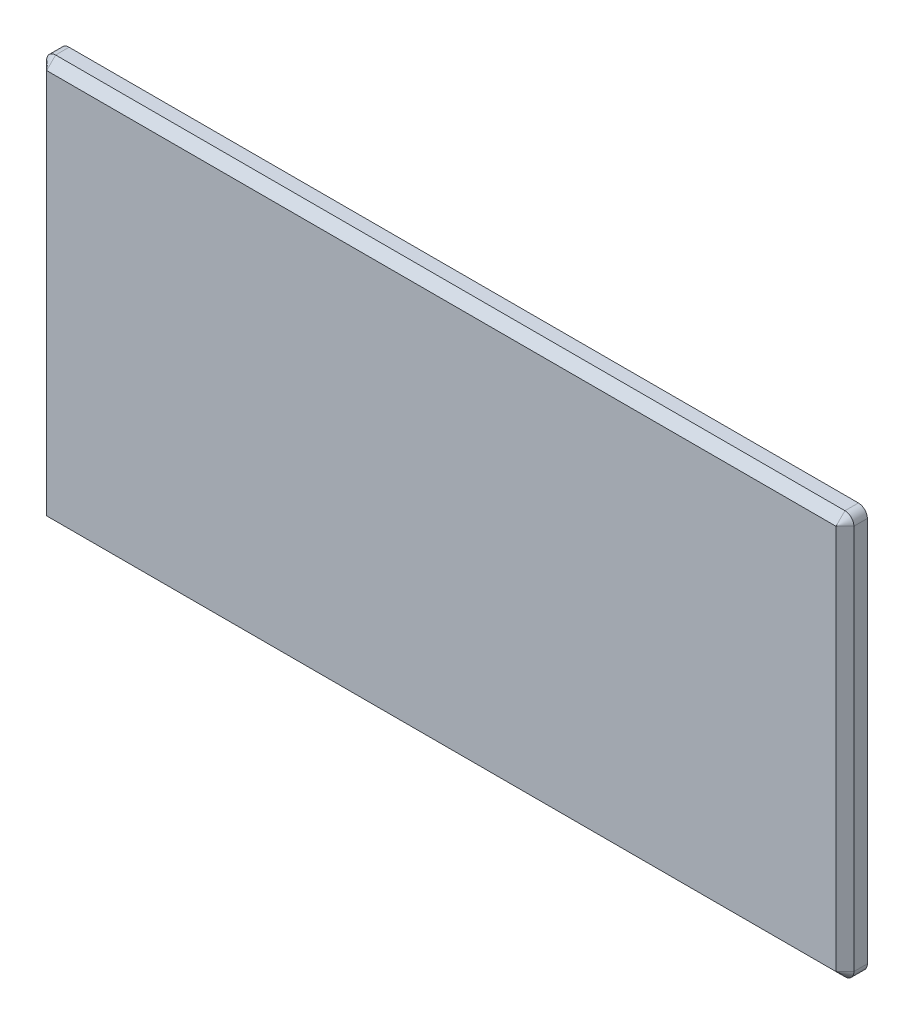
ISO-10303-21;
HEADER;
FILE_DESCRIPTION(('STEP AP214'),'2;1');
FILE_NAME('part.step','',(''),(''),'','','');
FILE_SCHEMA(('AUTOMOTIVE_DESIGN { 1 0 10303 214 1 1 1 1 }'));
ENDSEC;
DATA;
#1=APPLICATION_CONTEXT('core data for automotive mechanical design processes');
#2=APPLICATION_PROTOCOL_DEFINITION('international standard','automotive_design',2000,#1);
#3=PRODUCT_CONTEXT('',#1,'mechanical');
#4=PRODUCT('Part','Part','',(#3));
#5=PRODUCT_RELATED_PRODUCT_CATEGORY('part','',(#4));
#6=PRODUCT_DEFINITION_FORMATION('','',#4);
#7=PRODUCT_DEFINITION_CONTEXT('part definition',#1,'design');
#8=PRODUCT_DEFINITION('design','',#6,#7);
#9=PRODUCT_DEFINITION_SHAPE('','',#8);
#10=(LENGTH_UNIT() NAMED_UNIT(*) SI_UNIT(.MILLI.,.METRE.));
#11=(NAMED_UNIT(*) PLANE_ANGLE_UNIT() SI_UNIT($,.RADIAN.));
#12=(NAMED_UNIT(*) SI_UNIT($,.STERADIAN.) SOLID_ANGLE_UNIT());
#13=UNCERTAINTY_MEASURE_WITH_UNIT(LENGTH_MEASURE(1.E-05),#10,'distance_accuracy_value','');
#14=(GEOMETRIC_REPRESENTATION_CONTEXT(3) GLOBAL_UNCERTAINTY_ASSIGNED_CONTEXT((#13)) GLOBAL_UNIT_ASSIGNED_CONTEXT((#10,
#11,#12)) REPRESENTATION_CONTEXT('',''));
#15=CARTESIAN_POINT('',(0.,0.,0.));
#16=DIRECTION('',(0.,0.,1.));
#17=DIRECTION('',(1.,0.,0.));
#18=AXIS2_PLACEMENT_3D('',#15,#16,#17);
#19=CARTESIAN_POINT('',(45.,-22.5,2.5));
#20=DIRECTION('',(-1.,0.,0.));
#21=DIRECTION('',(0.,0.,1.));
#22=AXIS2_PLACEMENT_3D('',#19,#20,#21);
#23=PLANE('',#22);
#24=DIRECTION('',(0.,0.,-1.));
#25=VECTOR('',#24,1.);
#26=CARTESIAN_POINT('',(45.,21.5,2.5));
#27=LINE('',#26,#25);
#28=CARTESIAN_POINT('',(45.,21.5,0.));
#29=VERTEX_POINT('',#28);
#30=CARTESIAN_POINT('',(45.,21.5,1.5));
#31=VERTEX_POINT('',#30);
#32=EDGE_CURVE('E151',#29,#31,#27,.F.);
#33=ORIENTED_EDGE('',*,*,#32,.T.);
#34=DIRECTION('',(0.,-1.,0.));
#35=VECTOR('',#34,1.);
#36=CARTESIAN_POINT('',(45.,-22.5,1.5));
#37=LINE('',#36,#35);
#38=CARTESIAN_POINT('',(45.,-21.5,1.5));
#39=VERTEX_POINT('',#38);
#40=EDGE_CURVE('E170',#31,#39,#37,.T.);
#41=ORIENTED_EDGE('',*,*,#40,.T.);
#42=DIRECTION('',(0.,0.,-1.));
#43=VECTOR('',#42,1.);
#44=CARTESIAN_POINT('',(45.,-21.5,2.5));
#45=LINE('',#44,#43);
#46=CARTESIAN_POINT('',(45.,-21.5,0.));
#47=VERTEX_POINT('',#46);
#48=EDGE_CURVE('E149',#39,#47,#45,.T.);
#49=ORIENTED_EDGE('',*,*,#48,.T.);
#50=DIRECTION('',(0.,1.,0.));
#51=VECTOR('',#50,1.);
#52=CARTESIAN_POINT('',(45.,-22.5,0.));
#53=LINE('',#52,#51);
#54=EDGE_CURVE('E199',#47,#29,#53,.T.);
#55=ORIENTED_EDGE('',*,*,#54,.T.);
#56=EDGE_LOOP('',(#33,#41,#49,#55));
#57=FACE_BOUND('',#56,.T.);
#58=ADVANCED_FACE('F32',(#57),#23,.F.);
#59=CARTESIAN_POINT('',(-45.,22.5,2.5));
#60=DIRECTION('',(0.,-1.,0.));
#61=DIRECTION('',(0.,0.,-1.));
#62=AXIS2_PLACEMENT_3D('',#59,#60,#61);
#63=PLANE('',#62);
#64=DIRECTION('',(0.,0.,-1.));
#65=VECTOR('',#64,1.);
#66=CARTESIAN_POINT('',(-44.,22.5,2.5));
#67=LINE('',#66,#65);
#68=CARTESIAN_POINT('',(-44.,22.5,0.));
#69=VERTEX_POINT('',#68);
#70=CARTESIAN_POINT('',(-44.,22.5,1.5));
#71=VERTEX_POINT('',#70);
#72=EDGE_CURVE('E146',#69,#71,#67,.F.);
#73=ORIENTED_EDGE('',*,*,#72,.T.);
#74=DIRECTION('',(1.,0.,0.));
#75=VECTOR('',#74,1.);
#76=CARTESIAN_POINT('',(-45.,22.5,1.5));
#77=LINE('',#76,#75);
#78=CARTESIAN_POINT('',(44.,22.5,1.5));
#79=VERTEX_POINT('',#78);
#80=EDGE_CURVE('E166',#71,#79,#77,.T.);
#81=ORIENTED_EDGE('',*,*,#80,.T.);
#82=DIRECTION('',(0.,0.,-1.));
#83=VECTOR('',#82,1.);
#84=CARTESIAN_POINT('',(44.,22.5,2.5));
#85=LINE('',#84,#83);
#86=CARTESIAN_POINT('',(44.,22.5,0.));
#87=VERTEX_POINT('',#86);
#88=EDGE_CURVE('E144',#79,#87,#85,.T.);
#89=ORIENTED_EDGE('',*,*,#88,.T.);
#90=DIRECTION('',(-1.,0.,0.));
#91=VECTOR('',#90,1.);
#92=CARTESIAN_POINT('',(-45.,22.5,0.));
#93=LINE('',#92,#91);
#94=EDGE_CURVE('E134',#87,#69,#93,.T.);
#95=ORIENTED_EDGE('',*,*,#94,.T.);
#96=EDGE_LOOP('',(#73,#81,#89,#95));
#97=FACE_BOUND('',#96,.T.);
#98=ADVANCED_FACE('F253',(#97),#63,.F.);
#99=CARTESIAN_POINT('',(-45.,-22.5,2.5));
#100=DIRECTION('',(1.,0.,0.));
#101=DIRECTION('',(0.,0.,-1.));
#102=AXIS2_PLACEMENT_3D('',#99,#100,#101);
#103=PLANE('',#102);
#104=DIRECTION('',(0.,0.,-1.));
#105=VECTOR('',#104,1.);
#106=CARTESIAN_POINT('',(-45.,-21.5,2.5));
#107=LINE('',#106,#105);
#108=CARTESIAN_POINT('',(-45.,-21.5,0.));
#109=VERTEX_POINT('',#108);
#110=CARTESIAN_POINT('',(-45.,-21.5,1.5));
#111=VERTEX_POINT('',#110);
#112=EDGE_CURVE('E121',#109,#111,#107,.F.);
#113=ORIENTED_EDGE('',*,*,#112,.T.);
#114=DIRECTION('',(0.,1.,0.));
#115=VECTOR('',#114,1.);
#116=CARTESIAN_POINT('',(-45.,-22.5,1.5));
#117=LINE('',#116,#115);
#118=CARTESIAN_POINT('',(-45.,21.5,1.5));
#119=VERTEX_POINT('',#118);
#120=EDGE_CURVE('E11',#111,#119,#117,.T.);
#121=ORIENTED_EDGE('',*,*,#120,.T.);
#122=DIRECTION('',(0.,0.,-1.));
#123=VECTOR('',#122,1.);
#124=CARTESIAN_POINT('',(-45.,21.5,2.5));
#125=LINE('',#124,#123);
#126=CARTESIAN_POINT('',(-45.,21.5,0.));
#127=VERTEX_POINT('',#126);
#128=EDGE_CURVE('E125',#119,#127,#125,.T.);
#129=ORIENTED_EDGE('',*,*,#128,.T.);
#130=DIRECTION('',(0.,-1.,0.));
#131=VECTOR('',#130,1.);
#132=CARTESIAN_POINT('',(-45.,-22.5,0.));
#133=LINE('',#132,#131);
#134=EDGE_CURVE('E131',#127,#109,#133,.T.);
#135=ORIENTED_EDGE('',*,*,#134,.T.);
#136=EDGE_LOOP('',(#113,#121,#129,#135));
#137=FACE_BOUND('',#136,.T.);
#138=ADVANCED_FACE('F258',(#137),#103,.F.);
#139=CARTESIAN_POINT('',(-45.,-22.5,2.5));
#140=DIRECTION('',(0.,1.,0.));
#141=DIRECTION('',(0.,0.,1.));
#142=AXIS2_PLACEMENT_3D('',#139,#140,#141);
#143=PLANE('',#142);
#144=DIRECTION('',(0.,0.,-1.));
#145=VECTOR('',#144,1.);
#146=CARTESIAN_POINT('',(44.,-22.5,2.5));
#147=LINE('',#146,#145);
#148=CARTESIAN_POINT('',(44.,-22.5,0.));
#149=VERTEX_POINT('',#148);
#150=CARTESIAN_POINT('',(44.,-22.5,1.5));
#151=VERTEX_POINT('',#150);
#152=EDGE_CURVE('E117',#149,#151,#147,.F.);
#153=ORIENTED_EDGE('',*,*,#152,.T.);
#154=DIRECTION('',(-1.,0.,0.));
#155=VECTOR('',#154,1.);
#156=CARTESIAN_POINT('',(-45.,-22.5,1.5));
#157=LINE('',#156,#155);
#158=CARTESIAN_POINT('',(-44.,-22.5,1.5));
#159=VERTEX_POINT('',#158);
#160=EDGE_CURVE('E56',#151,#159,#157,.T.);
#161=ORIENTED_EDGE('',*,*,#160,.T.);
#162=DIRECTION('',(0.,0.,-1.));
#163=VECTOR('',#162,1.);
#164=CARTESIAN_POINT('',(-44.,-22.5,2.5));
#165=LINE('',#164,#163);
#166=CARTESIAN_POINT('',(-44.,-22.5,0.));
#167=VERTEX_POINT('',#166);
#168=EDGE_CURVE('E109',#159,#167,#165,.T.);
#169=ORIENTED_EDGE('',*,*,#168,.T.);
#170=DIRECTION('',(1.,0.,0.));
#171=VECTOR('',#170,1.);
#172=CARTESIAN_POINT('',(-45.,-22.5,0.));
#173=LINE('',#172,#171);
#174=EDGE_CURVE('E113',#167,#149,#173,.T.);
#175=ORIENTED_EDGE('',*,*,#174,.T.);
#176=EDGE_LOOP('',(#153,#161,#169,#175));
#177=FACE_BOUND('',#176,.T.);
#178=ADVANCED_FACE('F111',(#177),#143,.F.);
#179=CARTESIAN_POINT('',(0.,0.,2.5));
#180=DIRECTION('',(0.,0.,-1.));
#181=DIRECTION('',(-1.,0.,0.));
#182=AXIS2_PLACEMENT_3D('',#179,#180,#181);
#183=PLANE('',#182);
#184=DIRECTION('',(0.,1.,0.));
#185=VECTOR('',#184,1.);
#186=CARTESIAN_POINT('',(44.,0.,2.5));
#187=LINE('',#186,#185);
#188=CARTESIAN_POINT('',(44.,-21.5,2.5));
#189=VERTEX_POINT('',#188);
#190=CARTESIAN_POINT('',(44.,21.5,2.5));
#191=VERTEX_POINT('',#190);
#192=EDGE_CURVE('E161',#189,#191,#187,.T.);
#193=ORIENTED_EDGE('',*,*,#192,.T.);
#194=DIRECTION('',(-1.,0.,0.));
#195=VECTOR('',#194,1.);
#196=CARTESIAN_POINT('',(0.,21.5,2.5));
#197=LINE('',#196,#195);
#198=CARTESIAN_POINT('',(-44.,21.5,2.5));
#199=VERTEX_POINT('',#198);
#200=EDGE_CURVE('E163',#191,#199,#197,.T.);
#201=ORIENTED_EDGE('',*,*,#200,.T.);
#202=DIRECTION('',(0.,-1.,0.));
#203=VECTOR('',#202,1.);
#204=CARTESIAN_POINT('',(-44.,0.,2.5));
#205=LINE('',#204,#203);
#206=CARTESIAN_POINT('',(-44.,-21.5,2.5));
#207=VERTEX_POINT('',#206);
#208=EDGE_CURVE('E157',#199,#207,#205,.T.);
#209=ORIENTED_EDGE('',*,*,#208,.T.);
#210=DIRECTION('',(1.,0.,0.));
#211=VECTOR('',#210,1.);
#212=CARTESIAN_POINT('',(0.,-21.5,2.5));
#213=LINE('',#212,#211);
#214=EDGE_CURVE('E159',#207,#189,#213,.T.);
#215=ORIENTED_EDGE('',*,*,#214,.T.);
#216=EDGE_LOOP('',(#193,#201,#209,#215));
#217=FACE_BOUND('',#216,.T.);
#218=ADVANCED_FACE('F232',(#217),#183,.F.);
#219=CARTESIAN_POINT('',(0.,0.,0.));
#220=DIRECTION('',(0.,0.,-1.));
#221=DIRECTION('',(-1.,0.,0.));
#222=AXIS2_PLACEMENT_3D('',#219,#220,#221);
#223=PLANE('',#222);
#224=CARTESIAN_POINT('',(-22.5,0.,0.));
#225=DIRECTION('',(0.,0.,-1.));
#226=DIRECTION('',(-1.,0.,0.));
#227=AXIS2_PLACEMENT_3D('',#224,#225,#226);
#228=CIRCLE('',#227,4.);
#229=CARTESIAN_POINT('',(-26.5,0.,0.));
#230=VERTEX_POINT('',#229);
#231=EDGE_CURVE('E215',#230,#230,#228,.T.);
#232=ORIENTED_EDGE('',*,*,#231,.F.);
#233=EDGE_LOOP('',(#232));
#234=FACE_BOUND('',#233,.T.);
#235=CARTESIAN_POINT('',(22.5,0.,0.));
#236=DIRECTION('',(0.,0.,-1.));
#237=DIRECTION('',(-1.,0.,0.));
#238=AXIS2_PLACEMENT_3D('',#235,#236,#237);
#239=CIRCLE('',#238,4.);
#240=CARTESIAN_POINT('',(18.5,0.,0.));
#241=VERTEX_POINT('',#240);
#242=EDGE_CURVE('E209',#241,#241,#239,.T.);
#243=ORIENTED_EDGE('',*,*,#242,.F.);
#244=EDGE_LOOP('',(#243));
#245=FACE_BOUND('',#244,.T.);
#246=ORIENTED_EDGE('',*,*,#174,.F.);
#247=CARTESIAN_POINT('',(-44.,-21.5,0.));
#248=DIRECTION('',(0.,0.,-1.));
#249=DIRECTION('',(-1.,0.,0.));
#250=AXIS2_PLACEMENT_3D('',#247,#248,#249);
#251=CIRCLE('',#250,1.);
#252=EDGE_CURVE('E119',#167,#109,#251,.T.);
#253=ORIENTED_EDGE('',*,*,#252,.T.);
#254=ORIENTED_EDGE('',*,*,#134,.F.);
#255=CARTESIAN_POINT('',(-44.,21.5,0.));
#256=DIRECTION('',(0.,0.,-1.));
#257=DIRECTION('',(-1.,0.,0.));
#258=AXIS2_PLACEMENT_3D('',#255,#256,#257);
#259=CIRCLE('',#258,1.);
#260=EDGE_CURVE('E126',#127,#69,#259,.T.);
#261=ORIENTED_EDGE('',*,*,#260,.T.);
#262=ORIENTED_EDGE('',*,*,#94,.F.);
#263=CARTESIAN_POINT('',(44.,21.5,0.));
#264=DIRECTION('',(0.,0.,-1.));
#265=DIRECTION('',(-1.,0.,0.));
#266=AXIS2_PLACEMENT_3D('',#263,#264,#265);
#267=CIRCLE('',#266,1.);
#268=EDGE_CURVE('E139',#87,#29,#267,.T.);
#269=ORIENTED_EDGE('',*,*,#268,.T.);
#270=ORIENTED_EDGE('',*,*,#54,.F.);
#271=CARTESIAN_POINT('',(44.,-21.5,0.));
#272=DIRECTION('',(0.,0.,-1.));
#273=DIRECTION('',(-1.,0.,0.));
#274=AXIS2_PLACEMENT_3D('',#271,#272,#273);
#275=CIRCLE('',#274,1.);
#276=EDGE_CURVE('E116',#47,#149,#275,.T.);
#277=ORIENTED_EDGE('',*,*,#276,.T.);
#278=EDGE_LOOP('',(#246,#253,#254,#261,#262,#269,#270,#277));
#279=FACE_BOUND('',#278,.T.);
#280=ADVANCED_FACE('F128',(#234,#245,#279),#223,.T.);
#281=CARTESIAN_POINT('',(-44.,-21.5,2.5));
#282=DIRECTION('',(0.,0.,-1.));
#283=DIRECTION('',(-1.,0.,0.));
#284=AXIS2_PLACEMENT_3D('',#281,#282,#283);
#285=CYLINDRICAL_SURFACE('',#284,1.);
#286=ORIENTED_EDGE('',*,*,#168,.F.);
#287=CARTESIAN_POINT('',(-44.,-21.5,1.5));
#288=DIRECTION('',(0.,0.,-1.));
#289=DIRECTION('',(-1.,0.,0.));
#290=AXIS2_PLACEMENT_3D('',#287,#288,#289);
#291=CIRCLE('',#290,1.);
#292=EDGE_CURVE('E41',#159,#111,#291,.T.);
#293=ORIENTED_EDGE('',*,*,#292,.T.);
#294=ORIENTED_EDGE('',*,*,#112,.F.);
#295=ORIENTED_EDGE('',*,*,#252,.F.);
#296=EDGE_LOOP('',(#286,#293,#294,#295));
#297=FACE_BOUND('',#296,.T.);
#298=ADVANCED_FACE('F120',(#297),#285,.T.);
#299=CARTESIAN_POINT('',(-44.,21.5,2.5));
#300=DIRECTION('',(0.,0.,-1.));
#301=DIRECTION('',(-1.,0.,0.));
#302=AXIS2_PLACEMENT_3D('',#299,#300,#301);
#303=CYLINDRICAL_SURFACE('',#302,1.);
#304=ORIENTED_EDGE('',*,*,#128,.F.);
#305=CARTESIAN_POINT('',(-44.,21.5,1.5));
#306=DIRECTION('',(0.,0.,-1.));
#307=DIRECTION('',(-1.,0.,0.));
#308=AXIS2_PLACEMENT_3D('',#305,#306,#307);
#309=CIRCLE('',#308,1.);
#310=EDGE_CURVE('E154',#119,#71,#309,.T.);
#311=ORIENTED_EDGE('',*,*,#310,.T.);
#312=ORIENTED_EDGE('',*,*,#72,.F.);
#313=ORIENTED_EDGE('',*,*,#260,.F.);
#314=EDGE_LOOP('',(#304,#311,#312,#313));
#315=FACE_BOUND('',#314,.T.);
#316=ADVANCED_FACE('F265',(#315),#303,.T.);
#317=CARTESIAN_POINT('',(44.,21.5,2.5));
#318=DIRECTION('',(0.,0.,-1.));
#319=DIRECTION('',(-1.,0.,0.));
#320=AXIS2_PLACEMENT_3D('',#317,#318,#319);
#321=CYLINDRICAL_SURFACE('',#320,1.);
#322=ORIENTED_EDGE('',*,*,#88,.F.);
#323=CARTESIAN_POINT('',(44.,21.5,1.5));
#324=DIRECTION('',(0.,0.,-1.));
#325=DIRECTION('',(-1.,0.,0.));
#326=AXIS2_PLACEMENT_3D('',#323,#324,#325);
#327=CIRCLE('',#326,1.);
#328=EDGE_CURVE('E168',#79,#31,#327,.T.);
#329=ORIENTED_EDGE('',*,*,#328,.T.);
#330=ORIENTED_EDGE('',*,*,#32,.F.);
#331=ORIENTED_EDGE('',*,*,#268,.F.);
#332=EDGE_LOOP('',(#322,#329,#330,#331));
#333=FACE_BOUND('',#332,.T.);
#334=ADVANCED_FACE('F268',(#333),#321,.T.);
#335=CARTESIAN_POINT('',(44.,-21.5,2.5));
#336=DIRECTION('',(0.,0.,-1.));
#337=DIRECTION('',(-1.,0.,0.));
#338=AXIS2_PLACEMENT_3D('',#335,#336,#337);
#339=CYLINDRICAL_SURFACE('',#338,1.);
#340=ORIENTED_EDGE('',*,*,#48,.F.);
#341=CARTESIAN_POINT('',(44.,-21.5,1.5));
#342=DIRECTION('',(0.,0.,-1.));
#343=DIRECTION('',(-1.,0.,0.));
#344=AXIS2_PLACEMENT_3D('',#341,#342,#343);
#345=CIRCLE('',#344,1.);
#346=EDGE_CURVE('E172',#39,#151,#345,.T.);
#347=ORIENTED_EDGE('',*,*,#346,.T.);
#348=ORIENTED_EDGE('',*,*,#152,.F.);
#349=ORIENTED_EDGE('',*,*,#276,.F.);
#350=EDGE_LOOP('',(#340,#347,#348,#349));
#351=FACE_BOUND('',#350,.T.);
#352=ADVANCED_FACE('F272',(#351),#339,.T.);
#353=CARTESIAN_POINT('',(44.,-21.5,1.5));
#354=DIRECTION('',(0.,0.,-1.));
#355=DIRECTION('',(-1.,0.,0.));
#356=AXIS2_PLACEMENT_3D('',#353,#354,#355);
#357=CONICAL_SURFACE('',#356,0.999999999999987,0.785398163397442);
#358=DIRECTION('',(0.,0.707106781186543,0.707106781186552));
#359=VECTOR('',#358,1.);
#360=CARTESIAN_POINT('',(44.,-22.5,1.5));
#361=LINE('',#360,#359);
#362=EDGE_CURVE('E192',#151,#189,#361,.T.);
#363=ORIENTED_EDGE('',*,*,#362,.F.);
#364=ORIENTED_EDGE('',*,*,#346,.F.);
#365=DIRECTION('',(0.707106781186543,0.,-0.707106781186552));
#366=VECTOR('',#365,1.);
#367=CARTESIAN_POINT('',(44.,-21.5,2.5));
#368=LINE('',#367,#366);
#369=EDGE_CURVE('E36',#189,#39,#368,.T.);
#370=ORIENTED_EDGE('',*,*,#369,.F.);
#371=EDGE_LOOP('',(#363,#364,#370));
#372=FACE_BOUND('',#371,.T.);
#373=ADVANCED_FACE('F34',(#372),#357,.T.);
#374=CARTESIAN_POINT('',(44.,0.,2.5));
#375=DIRECTION('',(-0.707106781186552,0.,-0.707106781186543));
#376=DIRECTION('',(0.,1.,0.));
#377=AXIS2_PLACEMENT_3D('',#374,#375,#376);
#378=PLANE('',#377);
#379=ORIENTED_EDGE('',*,*,#369,.T.);
#380=ORIENTED_EDGE('',*,*,#40,.F.);
#381=DIRECTION('',(0.707106781186543,0.,-0.707106781186552));
#382=VECTOR('',#381,1.);
#383=CARTESIAN_POINT('',(44.,21.5,2.5));
#384=LINE('',#383,#382);
#385=EDGE_CURVE('E190',#191,#31,#384,.T.);
#386=ORIENTED_EDGE('',*,*,#385,.F.);
#387=ORIENTED_EDGE('',*,*,#192,.F.);
#388=EDGE_LOOP('',(#379,#380,#386,#387));
#389=FACE_BOUND('',#388,.T.);
#390=ADVANCED_FACE('F294',(#389),#378,.F.);
#391=CARTESIAN_POINT('',(0.,-21.5,2.5));
#392=DIRECTION('',(0.,0.707106781186552,-0.707106781186543));
#393=DIRECTION('',(1.,0.,0.));
#394=AXIS2_PLACEMENT_3D('',#391,#392,#393);
#395=PLANE('',#394);
#396=ORIENTED_EDGE('',*,*,#362,.T.);
#397=ORIENTED_EDGE('',*,*,#214,.F.);
#398=DIRECTION('',(0.,0.707106781186543,0.707106781186552));
#399=VECTOR('',#398,1.);
#400=CARTESIAN_POINT('',(-44.,-22.5,1.5));
#401=LINE('',#400,#399);
#402=EDGE_CURVE('E187',#159,#207,#401,.T.);
#403=ORIENTED_EDGE('',*,*,#402,.F.);
#404=ORIENTED_EDGE('',*,*,#160,.F.);
#405=EDGE_LOOP('',(#396,#397,#403,#404));
#406=FACE_BOUND('',#405,.T.);
#407=ADVANCED_FACE('F291',(#406),#395,.F.);
#408=CARTESIAN_POINT('',(44.,21.5,1.5));
#409=DIRECTION('',(0.,0.,-1.));
#410=DIRECTION('',(-1.,0.,0.));
#411=AXIS2_PLACEMENT_3D('',#408,#409,#410);
#412=CONICAL_SURFACE('',#411,0.999999999999987,0.785398163397442);
#413=ORIENTED_EDGE('',*,*,#385,.T.);
#414=ORIENTED_EDGE('',*,*,#328,.F.);
#415=DIRECTION('',(0.,0.707106781186543,-0.707106781186552));
#416=VECTOR('',#415,1.);
#417=CARTESIAN_POINT('',(44.,21.5,2.5));
#418=LINE('',#417,#416);
#419=EDGE_CURVE('E184',#191,#79,#418,.T.);
#420=ORIENTED_EDGE('',*,*,#419,.F.);
#421=EDGE_LOOP('',(#413,#414,#420));
#422=FACE_BOUND('',#421,.T.);
#423=ADVANCED_FACE('F287',(#422),#412,.T.);
#424=CARTESIAN_POINT('',(-44.,-21.5,1.5));
#425=DIRECTION('',(0.,0.,-1.));
#426=DIRECTION('',(-1.,0.,0.));
#427=AXIS2_PLACEMENT_3D('',#424,#425,#426);
#428=CONICAL_SURFACE('',#427,0.999999999999987,0.785398163397442);
#429=ORIENTED_EDGE('',*,*,#292,.F.);
#430=ORIENTED_EDGE('',*,*,#402,.T.);
#431=DIRECTION('',(0.707106781186543,0.,0.707106781186552));
#432=VECTOR('',#431,1.);
#433=CARTESIAN_POINT('',(-45.,-21.5,1.5));
#434=LINE('',#433,#432);
#435=EDGE_CURVE('E181',#111,#207,#434,.T.);
#436=ORIENTED_EDGE('',*,*,#435,.F.);
#437=EDGE_LOOP('',(#429,#430,#436));
#438=FACE_BOUND('',#437,.T.);
#439=ADVANCED_FACE('F283',(#438),#428,.T.);
#440=CARTESIAN_POINT('',(0.,21.5,2.5));
#441=DIRECTION('',(0.,-0.707106781186552,-0.707106781186543));
#442=DIRECTION('',(-1.,0.,0.));
#443=AXIS2_PLACEMENT_3D('',#440,#441,#442);
#444=PLANE('',#443);
#445=ORIENTED_EDGE('',*,*,#419,.T.);
#446=ORIENTED_EDGE('',*,*,#80,.F.);
#447=DIRECTION('',(0.,0.707106781186543,-0.707106781186552));
#448=VECTOR('',#447,1.);
#449=CARTESIAN_POINT('',(-44.,21.5,2.5));
#450=LINE('',#449,#448);
#451=EDGE_CURVE('E178',#199,#71,#450,.T.);
#452=ORIENTED_EDGE('',*,*,#451,.F.);
#453=ORIENTED_EDGE('',*,*,#200,.F.);
#454=EDGE_LOOP('',(#445,#446,#452,#453));
#455=FACE_BOUND('',#454,.T.);
#456=ADVANCED_FACE('F279',(#455),#444,.F.);
#457=CARTESIAN_POINT('',(-44.,0.,2.5));
#458=DIRECTION('',(0.707106781186552,0.,-0.707106781186543));
#459=DIRECTION('',(0.,-1.,0.));
#460=AXIS2_PLACEMENT_3D('',#457,#458,#459);
#461=PLANE('',#460);
#462=ORIENTED_EDGE('',*,*,#435,.T.);
#463=ORIENTED_EDGE('',*,*,#208,.F.);
#464=DIRECTION('',(0.707106781186543,0.,0.707106781186552));
#465=VECTOR('',#464,1.);
#466=CARTESIAN_POINT('',(-45.,21.5,1.5));
#467=LINE('',#466,#465);
#468=EDGE_CURVE('E176',#119,#199,#467,.T.);
#469=ORIENTED_EDGE('',*,*,#468,.F.);
#470=ORIENTED_EDGE('',*,*,#120,.F.);
#471=EDGE_LOOP('',(#462,#463,#469,#470));
#472=FACE_BOUND('',#471,.T.);
#473=ADVANCED_FACE('F247',(#472),#461,.F.);
#474=CARTESIAN_POINT('',(-44.,21.5,1.5));
#475=DIRECTION('',(0.,0.,-1.));
#476=DIRECTION('',(-1.,0.,0.));
#477=AXIS2_PLACEMENT_3D('',#474,#475,#476);
#478=CONICAL_SURFACE('',#477,0.999999999999987,0.785398163397442);
#479=ORIENTED_EDGE('',*,*,#451,.T.);
#480=ORIENTED_EDGE('',*,*,#310,.F.);
#481=ORIENTED_EDGE('',*,*,#468,.T.);
#482=EDGE_LOOP('',(#479,#480,#481));
#483=FACE_BOUND('',#482,.T.);
#484=ADVANCED_FACE('F238',(#483),#478,.T.);
#485=CARTESIAN_POINT('',(22.5,0.,-10.));
#486=DIRECTION('',(0.,0.,1.));
#487=DIRECTION('',(1.,0.,0.));
#488=AXIS2_PLACEMENT_3D('',#485,#486,#487);
#489=CYLINDRICAL_SURFACE('',#488,4.);
#490=CARTESIAN_POINT('',(22.5,0.,-10.));
#491=DIRECTION('',(0.,0.,-1.));
#492=DIRECTION('',(-1.,0.,0.));
#493=AXIS2_PLACEMENT_3D('',#490,#491,#492);
#494=CIRCLE('',#493,4.);
#495=CARTESIAN_POINT('',(18.5,0.,-10.));
#496=VERTEX_POINT('',#495);
#497=EDGE_CURVE('E179',#496,#496,#494,.T.);
#498=ORIENTED_EDGE('',*,*,#497,.F.);
#499=EDGE_LOOP('',(#498));
#500=FACE_BOUND('',#499,.T.);
#501=ORIENTED_EDGE('',*,*,#242,.T.);
#502=EDGE_LOOP('',(#501));
#503=FACE_BOUND('',#502,.T.);
#504=ADVANCED_FACE('F236',(#500,#503),#489,.T.);
#505=CARTESIAN_POINT('',(22.5,0.,-10.));
#506=DIRECTION('',(0.,0.,-1.));
#507=DIRECTION('',(-1.,0.,0.));
#508=AXIS2_PLACEMENT_3D('',#505,#506,#507);
#509=PLANE('',#508);
#510=ORIENTED_EDGE('',*,*,#497,.T.);
#511=EDGE_LOOP('',(#510));
#512=FACE_BOUND('',#511,.T.);
#513=ADVANCED_FACE('F226',(#512),#509,.T.);
#514=CARTESIAN_POINT('',(-22.5,0.,-10.));
#515=DIRECTION('',(0.,0.,1.));
#516=DIRECTION('',(1.,0.,0.));
#517=AXIS2_PLACEMENT_3D('',#514,#515,#516);
#518=CYLINDRICAL_SURFACE('',#517,4.);
#519=CARTESIAN_POINT('',(-22.5,0.,-10.));
#520=DIRECTION('',(0.,0.,-1.));
#521=DIRECTION('',(-1.,0.,0.));
#522=AXIS2_PLACEMENT_3D('',#519,#520,#521);
#523=CIRCLE('',#522,4.);
#524=CARTESIAN_POINT('',(-26.5,0.,-10.));
#525=VERTEX_POINT('',#524);
#526=EDGE_CURVE('E212',#525,#525,#523,.T.);
#527=ORIENTED_EDGE('',*,*,#526,.F.);
#528=EDGE_LOOP('',(#527));
#529=FACE_BOUND('',#528,.T.);
#530=ORIENTED_EDGE('',*,*,#231,.T.);
#531=EDGE_LOOP('',(#530));
#532=FACE_BOUND('',#531,.T.);
#533=ADVANCED_FACE('F223',(#529,#532),#518,.T.);
#534=CARTESIAN_POINT('',(-22.5,0.,-10.));
#535=DIRECTION('',(0.,0.,-1.));
#536=DIRECTION('',(-1.,0.,0.));
#537=AXIS2_PLACEMENT_3D('',#534,#535,#536);
#538=PLANE('',#537);
#539=ORIENTED_EDGE('',*,*,#526,.T.);
#540=EDGE_LOOP('',(#539));
#541=FACE_BOUND('',#540,.T.);
#542=ADVANCED_FACE('F221',(#541),#538,.T.);
#543=CLOSED_SHELL('',(#58,#98,#138,#178,#218,#280,#298,#316,#334,#352,#373,#390,#407,#423,#439,
#456,#473,#484,#504,#513,#533,#542));
#544=MANIFOLD_SOLID_BREP('B2',#543);
#545=ADVANCED_BREP_SHAPE_REPRESENTATION('',(#18,#544),#14);
#546=SHAPE_DEFINITION_REPRESENTATION(#9,#545);
ENDSEC;
END-ISO-10303-21;
